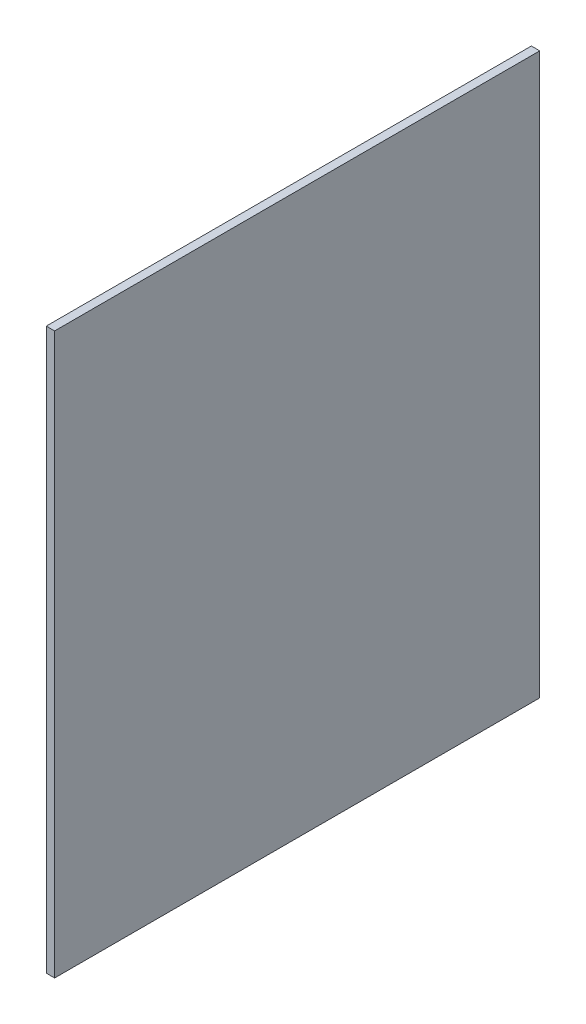
ISO-10303-21;
HEADER;
FILE_DESCRIPTION(('STEP AP214'),'2;1');
FILE_NAME('part.step','',(''),(''),'','','');
FILE_SCHEMA(('AUTOMOTIVE_DESIGN { 1 0 10303 214 1 1 1 1 }'));
ENDSEC;
DATA;
#1=APPLICATION_CONTEXT('core data for automotive mechanical design processes');
#2=APPLICATION_PROTOCOL_DEFINITION('international standard','automotive_design',2000,#1);
#3=PRODUCT_CONTEXT('',#1,'mechanical');
#4=PRODUCT('Part','Part','',(#3));
#5=PRODUCT_RELATED_PRODUCT_CATEGORY('part','',(#4));
#6=PRODUCT_DEFINITION_FORMATION('','',#4);
#7=PRODUCT_DEFINITION_CONTEXT('part definition',#1,'design');
#8=PRODUCT_DEFINITION('design','',#6,#7);
#9=PRODUCT_DEFINITION_SHAPE('','',#8);
#10=(LENGTH_UNIT() NAMED_UNIT(*) SI_UNIT(.MILLI.,.METRE.));
#11=(NAMED_UNIT(*) PLANE_ANGLE_UNIT() SI_UNIT($,.RADIAN.));
#12=(NAMED_UNIT(*) SI_UNIT($,.STERADIAN.) SOLID_ANGLE_UNIT());
#13=UNCERTAINTY_MEASURE_WITH_UNIT(LENGTH_MEASURE(1.E-05),#10,'distance_accuracy_value','');
#14=(GEOMETRIC_REPRESENTATION_CONTEXT(3) GLOBAL_UNCERTAINTY_ASSIGNED_CONTEXT((#13)) GLOBAL_UNIT_ASSIGNED_CONTEXT((#10,
#11,#12)) REPRESENTATION_CONTEXT('',''));
#15=CARTESIAN_POINT('',(0.,0.,0.));
#16=DIRECTION('',(0.,0.,1.));
#17=DIRECTION('',(1.,0.,0.));
#18=AXIS2_PLACEMENT_3D('',#15,#16,#17);
#19=CARTESIAN_POINT('',(10.,38.9560238095075,101.075088803047));
#20=DIRECTION('',(0.,0.,-1.));
#21=DIRECTION('',(0.,1.,0.));
#22=AXIS2_PLACEMENT_3D('',#19,#20,#21);
#23=PLANE('',#22);
#24=DIRECTION('',(0.,-1.,0.));
#25=VECTOR('',#24,1.);
#26=CARTESIAN_POINT('',(0.,38.9560238095075,101.075088803047));
#27=LINE('',#26,#25);
#28=CARTESIAN_POINT('',(0.,38.9560238095075,101.075088803047));
#29=VERTEX_POINT('',#28);
#30=CARTESIAN_POINT('',(0.,-631.043976190492,101.075088803046));
#31=VERTEX_POINT('',#30);
#32=EDGE_CURVE('E97',#29,#31,#27,.T.);
#33=ORIENTED_EDGE('',*,*,#32,.T.);
#34=DIRECTION('',(-1.,0.,0.));
#35=VECTOR('',#34,1.);
#36=CARTESIAN_POINT('',(10.,-631.043976190492,101.075088803046));
#37=LINE('',#36,#35);
#38=CARTESIAN_POINT('',(10.,-631.043976190492,101.075088803046));
#39=VERTEX_POINT('',#38);
#40=EDGE_CURVE('E11',#39,#31,#37,.T.);
#41=ORIENTED_EDGE('',*,*,#40,.F.);
#42=DIRECTION('',(0.,-1.,0.));
#43=VECTOR('',#42,1.);
#44=CARTESIAN_POINT('',(10.,38.9560238095075,101.075088803047));
#45=LINE('',#44,#43);
#46=CARTESIAN_POINT('',(10.,38.9560238095075,101.075088803047));
#47=VERTEX_POINT('',#46);
#48=EDGE_CURVE('E85',#47,#39,#45,.T.);
#49=ORIENTED_EDGE('',*,*,#48,.F.);
#50=DIRECTION('',(-1.,0.,0.));
#51=VECTOR('',#50,1.);
#52=CARTESIAN_POINT('',(10.,38.9560238095075,101.075088803047));
#53=LINE('',#52,#51);
#54=EDGE_CURVE('E93',#47,#29,#53,.T.);
#55=ORIENTED_EDGE('',*,*,#54,.T.);
#56=EDGE_LOOP('',(#33,#41,#49,#55));
#57=FACE_BOUND('',#56,.T.);
#58=ADVANCED_FACE('F34',(#57),#23,.F.);
#59=CARTESIAN_POINT('',(10.,-631.043976190492,101.075088803046));
#60=DIRECTION('',(0.,1.,0.));
#61=DIRECTION('',(0.,0.,1.));
#62=AXIS2_PLACEMENT_3D('',#59,#60,#61);
#63=PLANE('',#62);
#64=DIRECTION('',(0.,0.,-1.));
#65=VECTOR('',#64,1.);
#66=CARTESIAN_POINT('',(0.,-631.043976190492,101.075088803046));
#67=LINE('',#66,#65);
#68=CARTESIAN_POINT('',(0.,-631.043976190492,-478.924911196954));
#69=VERTEX_POINT('',#68);
#70=EDGE_CURVE('E89',#31,#69,#67,.T.);
#71=ORIENTED_EDGE('',*,*,#70,.T.);
#72=DIRECTION('',(-1.,0.,0.));
#73=VECTOR('',#72,1.);
#74=CARTESIAN_POINT('',(10.,-631.043976190492,-478.924911196954));
#75=LINE('',#74,#73);
#76=CARTESIAN_POINT('',(10.,-631.043976190492,-478.924911196954));
#77=VERTEX_POINT('',#76);
#78=EDGE_CURVE('E42',#77,#69,#75,.T.);
#79=ORIENTED_EDGE('',*,*,#78,.F.);
#80=DIRECTION('',(0.,0.,-1.));
#81=VECTOR('',#80,1.);
#82=CARTESIAN_POINT('',(10.,-631.043976190492,101.075088803046));
#83=LINE('',#82,#81);
#84=EDGE_CURVE('E80',#39,#77,#83,.T.);
#85=ORIENTED_EDGE('',*,*,#84,.F.);
#86=ORIENTED_EDGE('',*,*,#40,.T.);
#87=EDGE_LOOP('',(#71,#79,#85,#86));
#88=FACE_BOUND('',#87,.T.);
#89=ADVANCED_FACE('F88',(#88),#63,.F.);
#90=CARTESIAN_POINT('',(10.,38.9560238095075,-478.924911196953));
#91=DIRECTION('',(0.,0.,1.));
#92=DIRECTION('',(0.,-1.,0.));
#93=AXIS2_PLACEMENT_3D('',#90,#91,#92);
#94=PLANE('',#93);
#95=DIRECTION('',(0.,1.,0.));
#96=VECTOR('',#95,1.);
#97=CARTESIAN_POINT('',(0.,38.9560238095075,-478.924911196953));
#98=LINE('',#97,#96);
#99=CARTESIAN_POINT('',(0.,38.9560238095075,-478.924911196953));
#100=VERTEX_POINT('',#99);
#101=EDGE_CURVE('E67',#69,#100,#98,.T.);
#102=ORIENTED_EDGE('',*,*,#101,.T.);
#103=DIRECTION('',(-1.,0.,0.));
#104=VECTOR('',#103,1.);
#105=CARTESIAN_POINT('',(10.,38.9560238095075,-478.924911196953));
#106=LINE('',#105,#104);
#107=CARTESIAN_POINT('',(10.,38.9560238095075,-478.924911196953));
#108=VERTEX_POINT('',#107);
#109=EDGE_CURVE('E90',#108,#100,#106,.T.);
#110=ORIENTED_EDGE('',*,*,#109,.F.);
#111=DIRECTION('',(0.,1.,0.));
#112=VECTOR('',#111,1.);
#113=CARTESIAN_POINT('',(10.,38.9560238095075,-478.924911196953));
#114=LINE('',#113,#112);
#115=EDGE_CURVE('E83',#77,#108,#114,.T.);
#116=ORIENTED_EDGE('',*,*,#115,.F.);
#117=ORIENTED_EDGE('',*,*,#78,.T.);
#118=EDGE_LOOP('',(#102,#110,#116,#117));
#119=FACE_BOUND('',#118,.T.);
#120=ADVANCED_FACE('F91',(#119),#94,.F.);
#121=CARTESIAN_POINT('',(10.,38.9560238095075,101.075088803047));
#122=DIRECTION('',(0.,-1.,0.));
#123=DIRECTION('',(0.,0.,-1.));
#124=AXIS2_PLACEMENT_3D('',#121,#122,#123);
#125=PLANE('',#124);
#126=DIRECTION('',(0.,0.,1.));
#127=VECTOR('',#126,1.);
#128=CARTESIAN_POINT('',(0.,38.9560238095075,101.075088803047));
#129=LINE('',#128,#127);
#130=EDGE_CURVE('E73',#100,#29,#129,.T.);
#131=ORIENTED_EDGE('',*,*,#130,.T.);
#132=ORIENTED_EDGE('',*,*,#54,.F.);
#133=DIRECTION('',(0.,0.,1.));
#134=VECTOR('',#133,1.);
#135=CARTESIAN_POINT('',(10.,38.9560238095075,101.075088803047));
#136=LINE('',#135,#134);
#137=EDGE_CURVE('E50',#108,#47,#136,.T.);
#138=ORIENTED_EDGE('',*,*,#137,.F.);
#139=ORIENTED_EDGE('',*,*,#109,.T.);
#140=EDGE_LOOP('',(#131,#132,#138,#139));
#141=FACE_BOUND('',#140,.T.);
#142=ADVANCED_FACE('F104',(#141),#125,.F.);
#143=CARTESIAN_POINT('',(10.,0.,0.));
#144=DIRECTION('',(1.,0.,0.));
#145=DIRECTION('',(0.,0.,-1.));
#146=AXIS2_PLACEMENT_3D('',#143,#144,#145);
#147=PLANE('',#146);
#148=ORIENTED_EDGE('',*,*,#48,.T.);
#149=ORIENTED_EDGE('',*,*,#84,.T.);
#150=ORIENTED_EDGE('',*,*,#115,.T.);
#151=ORIENTED_EDGE('',*,*,#137,.T.);
#152=EDGE_LOOP('',(#148,#149,#150,#151));
#153=FACE_BOUND('',#152,.T.);
#154=ADVANCED_FACE('F81',(#153),#147,.T.);
#155=CARTESIAN_POINT('',(0.,0.,0.));
#156=DIRECTION('',(1.,0.,0.));
#157=DIRECTION('',(0.,0.,-1.));
#158=AXIS2_PLACEMENT_3D('',#155,#156,#157);
#159=PLANE('',#158);
#160=ORIENTED_EDGE('',*,*,#32,.F.);
#161=ORIENTED_EDGE('',*,*,#130,.F.);
#162=ORIENTED_EDGE('',*,*,#101,.F.);
#163=ORIENTED_EDGE('',*,*,#70,.F.);
#164=EDGE_LOOP('',(#160,#161,#162,#163));
#165=FACE_BOUND('',#164,.T.);
#166=ADVANCED_FACE('F107',(#165),#159,.F.);
#167=CLOSED_SHELL('',(#58,#89,#120,#142,#154,#166));
#168=MANIFOLD_SOLID_BREP('B2',#167);
#169=ADVANCED_BREP_SHAPE_REPRESENTATION('',(#18,#168),#14);
#170=SHAPE_DEFINITION_REPRESENTATION(#9,#169);
ENDSEC;
END-ISO-10303-21;
